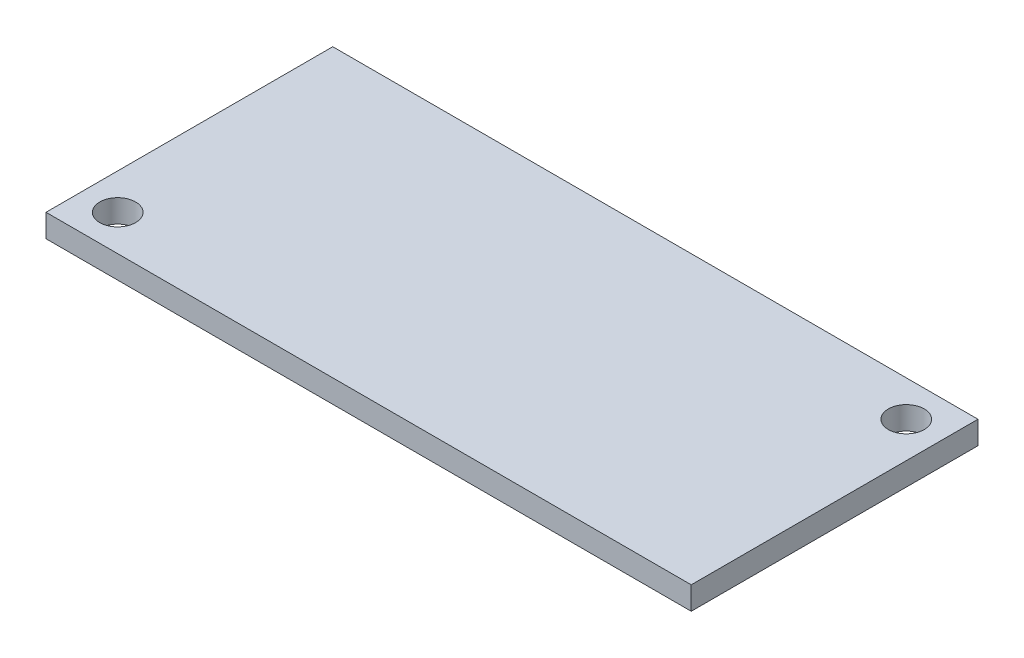
ISO-10303-21;
HEADER;
FILE_DESCRIPTION(('STEP AP214'),'2;1');
FILE_NAME('part.step','',(''),(''),'','','');
FILE_SCHEMA(('AUTOMOTIVE_DESIGN { 1 0 10303 214 1 1 1 1 }'));
ENDSEC;
DATA;
#1=APPLICATION_CONTEXT('core data for automotive mechanical design processes');
#2=APPLICATION_PROTOCOL_DEFINITION('international standard','automotive_design',2000,#1);
#3=PRODUCT_CONTEXT('',#1,'mechanical');
#4=PRODUCT('Part','Part','',(#3));
#5=PRODUCT_RELATED_PRODUCT_CATEGORY('part','',(#4));
#6=PRODUCT_DEFINITION_FORMATION('','',#4);
#7=PRODUCT_DEFINITION_CONTEXT('part definition',#1,'design');
#8=PRODUCT_DEFINITION('design','',#6,#7);
#9=PRODUCT_DEFINITION_SHAPE('','',#8);
#10=(LENGTH_UNIT() NAMED_UNIT(*) SI_UNIT(.MILLI.,.METRE.));
#11=(NAMED_UNIT(*) PLANE_ANGLE_UNIT() SI_UNIT($,.RADIAN.));
#12=(NAMED_UNIT(*) SI_UNIT($,.STERADIAN.) SOLID_ANGLE_UNIT());
#13=UNCERTAINTY_MEASURE_WITH_UNIT(LENGTH_MEASURE(1.E-05),#10,'distance_accuracy_value','');
#14=(GEOMETRIC_REPRESENTATION_CONTEXT(3) GLOBAL_UNCERTAINTY_ASSIGNED_CONTEXT((#13)) GLOBAL_UNIT_ASSIGNED_CONTEXT((#10,
#11,#12)) REPRESENTATION_CONTEXT('',''));
#15=CARTESIAN_POINT('',(0.,0.,0.));
#16=DIRECTION('',(0.,0.,1.));
#17=DIRECTION('',(1.,0.,0.));
#18=AXIS2_PLACEMENT_3D('',#15,#16,#17);
#19=CARTESIAN_POINT('',(22.5,1.6,10.));
#20=DIRECTION('',(-1.,0.,0.));
#21=DIRECTION('',(0.,0.,1.));
#22=AXIS2_PLACEMENT_3D('',#19,#20,#21);
#23=PLANE('',#22);
#24=DIRECTION('',(0.,0.,-1.));
#25=VECTOR('',#24,1.);
#26=CARTESIAN_POINT('',(22.5,0.,10.));
#27=LINE('',#26,#25);
#28=CARTESIAN_POINT('',(22.5,0.,10.));
#29=VERTEX_POINT('',#28);
#30=CARTESIAN_POINT('',(22.5,0.,-10.));
#31=VERTEX_POINT('',#30);
#32=EDGE_CURVE('E95',#29,#31,#27,.T.);
#33=ORIENTED_EDGE('',*,*,#32,.T.);
#34=DIRECTION('',(0.,-1.,0.));
#35=VECTOR('',#34,1.);
#36=CARTESIAN_POINT('',(22.5,1.6,-10.));
#37=LINE('',#36,#35);
#38=CARTESIAN_POINT('',(22.5,1.6,-10.));
#39=VERTEX_POINT('',#38);
#40=EDGE_CURVE('E11',#39,#31,#37,.T.);
#41=ORIENTED_EDGE('',*,*,#40,.F.);
#42=DIRECTION('',(0.,0.,-1.));
#43=VECTOR('',#42,1.);
#44=CARTESIAN_POINT('',(22.5,1.6,10.));
#45=LINE('',#44,#43);
#46=CARTESIAN_POINT('',(22.5,1.6,10.));
#47=VERTEX_POINT('',#46);
#48=EDGE_CURVE('E83',#47,#39,#45,.T.);
#49=ORIENTED_EDGE('',*,*,#48,.F.);
#50=DIRECTION('',(0.,-1.,0.));
#51=VECTOR('',#50,1.);
#52=CARTESIAN_POINT('',(22.5,1.6,10.));
#53=LINE('',#52,#51);
#54=EDGE_CURVE('E91',#47,#29,#53,.T.);
#55=ORIENTED_EDGE('',*,*,#54,.T.);
#56=EDGE_LOOP('',(#33,#41,#49,#55));
#57=FACE_BOUND('',#56,.T.);
#58=ADVANCED_FACE('F32',(#57),#23,.F.);
#59=CARTESIAN_POINT('',(-22.5,1.6,-10.));
#60=DIRECTION('',(0.,0.,1.));
#61=DIRECTION('',(1.,0.,0.));
#62=AXIS2_PLACEMENT_3D('',#59,#60,#61);
#63=PLANE('',#62);
#64=DIRECTION('',(-1.,0.,0.));
#65=VECTOR('',#64,1.);
#66=CARTESIAN_POINT('',(-22.5,0.,-10.));
#67=LINE('',#66,#65);
#68=CARTESIAN_POINT('',(-22.5,0.,-10.));
#69=VERTEX_POINT('',#68);
#70=EDGE_CURVE('E87',#31,#69,#67,.T.);
#71=ORIENTED_EDGE('',*,*,#70,.T.);
#72=DIRECTION('',(0.,-1.,0.));
#73=VECTOR('',#72,1.);
#74=CARTESIAN_POINT('',(-22.5,1.6,-10.));
#75=LINE('',#74,#73);
#76=CARTESIAN_POINT('',(-22.5,1.6,-10.));
#77=VERTEX_POINT('',#76);
#78=EDGE_CURVE('E40',#77,#69,#75,.T.);
#79=ORIENTED_EDGE('',*,*,#78,.F.);
#80=DIRECTION('',(-1.,0.,0.));
#81=VECTOR('',#80,1.);
#82=CARTESIAN_POINT('',(-22.5,1.6,-10.));
#83=LINE('',#82,#81);
#84=EDGE_CURVE('E78',#39,#77,#83,.T.);
#85=ORIENTED_EDGE('',*,*,#84,.F.);
#86=ORIENTED_EDGE('',*,*,#40,.T.);
#87=EDGE_LOOP('',(#71,#79,#85,#86));
#88=FACE_BOUND('',#87,.T.);
#89=ADVANCED_FACE('F86',(#88),#63,.F.);
#90=CARTESIAN_POINT('',(-22.5,1.6,10.));
#91=DIRECTION('',(1.,0.,0.));
#92=DIRECTION('',(0.,0.,-1.));
#93=AXIS2_PLACEMENT_3D('',#90,#91,#92);
#94=PLANE('',#93);
#95=DIRECTION('',(0.,0.,1.));
#96=VECTOR('',#95,1.);
#97=CARTESIAN_POINT('',(-22.5,0.,10.));
#98=LINE('',#97,#96);
#99=CARTESIAN_POINT('',(-22.5,0.,10.));
#100=VERTEX_POINT('',#99);
#101=EDGE_CURVE('E65',#69,#100,#98,.T.);
#102=ORIENTED_EDGE('',*,*,#101,.T.);
#103=DIRECTION('',(0.,-1.,0.));
#104=VECTOR('',#103,1.);
#105=CARTESIAN_POINT('',(-22.5,1.6,10.));
#106=LINE('',#105,#104);
#107=CARTESIAN_POINT('',(-22.5,1.6,10.));
#108=VERTEX_POINT('',#107);
#109=EDGE_CURVE('E88',#108,#100,#106,.T.);
#110=ORIENTED_EDGE('',*,*,#109,.F.);
#111=DIRECTION('',(0.,0.,1.));
#112=VECTOR('',#111,1.);
#113=CARTESIAN_POINT('',(-22.5,1.6,10.));
#114=LINE('',#113,#112);
#115=EDGE_CURVE('E81',#77,#108,#114,.T.);
#116=ORIENTED_EDGE('',*,*,#115,.F.);
#117=ORIENTED_EDGE('',*,*,#78,.T.);
#118=EDGE_LOOP('',(#102,#110,#116,#117));
#119=FACE_BOUND('',#118,.T.);
#120=ADVANCED_FACE('F89',(#119),#94,.F.);
#121=CARTESIAN_POINT('',(-22.5,1.6,10.));
#122=DIRECTION('',(0.,0.,-1.));
#123=DIRECTION('',(-1.,0.,0.));
#124=AXIS2_PLACEMENT_3D('',#121,#122,#123);
#125=PLANE('',#124);
#126=DIRECTION('',(1.,0.,0.));
#127=VECTOR('',#126,1.);
#128=CARTESIAN_POINT('',(-22.5,0.,10.));
#129=LINE('',#128,#127);
#130=EDGE_CURVE('E71',#100,#29,#129,.T.);
#131=ORIENTED_EDGE('',*,*,#130,.T.);
#132=ORIENTED_EDGE('',*,*,#54,.F.);
#133=DIRECTION('',(1.,0.,0.));
#134=VECTOR('',#133,1.);
#135=CARTESIAN_POINT('',(-22.5,1.6,10.));
#136=LINE('',#135,#134);
#137=EDGE_CURVE('E48',#108,#47,#136,.T.);
#138=ORIENTED_EDGE('',*,*,#137,.F.);
#139=ORIENTED_EDGE('',*,*,#109,.T.);
#140=EDGE_LOOP('',(#131,#132,#138,#139));
#141=FACE_BOUND('',#140,.T.);
#142=ADVANCED_FACE('F103',(#141),#125,.F.);
#143=CARTESIAN_POINT('',(0.,1.6,0.));
#144=DIRECTION('',(0.,-1.,0.));
#145=DIRECTION('',(0.,0.,-1.));
#146=AXIS2_PLACEMENT_3D('',#143,#144,#145);
#147=PLANE('',#146);
#148=CARTESIAN_POINT('',(20.,1.6,-7.5));
#149=DIRECTION('',(0.,1.,0.));
#150=DIRECTION('',(0.,0.,1.));
#151=AXIS2_PLACEMENT_3D('',#148,#149,#150);
#152=CIRCLE('',#151,1.25);
#153=CARTESIAN_POINT('',(20.,1.6,-6.25));
#154=VERTEX_POINT('',#153);
#155=EDGE_CURVE('E115',#154,#154,#152,.T.);
#156=ORIENTED_EDGE('',*,*,#155,.F.);
#157=EDGE_LOOP('',(#156));
#158=FACE_BOUND('',#157,.T.);
#159=CARTESIAN_POINT('',(-20.,1.6,7.5));
#160=DIRECTION('',(0.,1.,0.));
#161=DIRECTION('',(0.,0.,1.));
#162=AXIS2_PLACEMENT_3D('',#159,#160,#161);
#163=CIRCLE('',#162,1.25);
#164=CARTESIAN_POINT('',(-20.,1.6,8.75));
#165=VERTEX_POINT('',#164);
#166=EDGE_CURVE('E109',#165,#165,#163,.T.);
#167=ORIENTED_EDGE('',*,*,#166,.F.);
#168=EDGE_LOOP('',(#167));
#169=FACE_BOUND('',#168,.T.);
#170=ORIENTED_EDGE('',*,*,#48,.T.);
#171=ORIENTED_EDGE('',*,*,#84,.T.);
#172=ORIENTED_EDGE('',*,*,#115,.T.);
#173=ORIENTED_EDGE('',*,*,#137,.T.);
#174=EDGE_LOOP('',(#170,#171,#172,#173));
#175=FACE_BOUND('',#174,.T.);
#176=ADVANCED_FACE('F79',(#158,#169,#175),#147,.F.);
#177=CARTESIAN_POINT('',(0.,0.,0.));
#178=DIRECTION('',(0.,-1.,0.));
#179=DIRECTION('',(0.,0.,-1.));
#180=AXIS2_PLACEMENT_3D('',#177,#178,#179);
#181=PLANE('',#180);
#182=CARTESIAN_POINT('',(20.,0.,-7.5));
#183=DIRECTION('',(0.,1.,0.));
#184=DIRECTION('',(0.,0.,1.));
#185=AXIS2_PLACEMENT_3D('',#182,#183,#184);
#186=CIRCLE('',#185,1.25);
#187=CARTESIAN_POINT('',(20.,0.,-6.25));
#188=VERTEX_POINT('',#187);
#189=EDGE_CURVE('E112',#188,#188,#186,.T.);
#190=ORIENTED_EDGE('',*,*,#189,.T.);
#191=EDGE_LOOP('',(#190));
#192=FACE_BOUND('',#191,.T.);
#193=CARTESIAN_POINT('',(-20.,0.,7.5));
#194=DIRECTION('',(0.,1.,0.));
#195=DIRECTION('',(0.,0.,1.));
#196=AXIS2_PLACEMENT_3D('',#193,#194,#195);
#197=CIRCLE('',#196,1.25);
#198=CARTESIAN_POINT('',(-20.,0.,8.75));
#199=VERTEX_POINT('',#198);
#200=EDGE_CURVE('E98',#199,#199,#197,.T.);
#201=ORIENTED_EDGE('',*,*,#200,.T.);
#202=EDGE_LOOP('',(#201));
#203=FACE_BOUND('',#202,.T.);
#204=ORIENTED_EDGE('',*,*,#32,.F.);
#205=ORIENTED_EDGE('',*,*,#130,.F.);
#206=ORIENTED_EDGE('',*,*,#101,.F.);
#207=ORIENTED_EDGE('',*,*,#70,.F.);
#208=EDGE_LOOP('',(#204,#205,#206,#207));
#209=FACE_BOUND('',#208,.T.);
#210=ADVANCED_FACE('F106',(#192,#203,#209),#181,.T.);
#211=CARTESIAN_POINT('',(-20.,0.,7.5));
#212=DIRECTION('',(0.,1.,0.));
#213=DIRECTION('',(0.,0.,1.));
#214=AXIS2_PLACEMENT_3D('',#211,#212,#213);
#215=CYLINDRICAL_SURFACE('',#214,1.25);
#216=ORIENTED_EDGE('',*,*,#200,.F.);
#217=EDGE_LOOP('',(#216));
#218=FACE_BOUND('',#217,.T.);
#219=ORIENTED_EDGE('',*,*,#166,.T.);
#220=EDGE_LOOP('',(#219));
#221=FACE_BOUND('',#220,.T.);
#222=ADVANCED_FACE('F126',(#218,#221),#215,.F.);
#223=CARTESIAN_POINT('',(20.,0.,-7.5));
#224=DIRECTION('',(0.,1.,0.));
#225=DIRECTION('',(0.,0.,1.));
#226=AXIS2_PLACEMENT_3D('',#223,#224,#225);
#227=CYLINDRICAL_SURFACE('',#226,1.25);
#228=ORIENTED_EDGE('',*,*,#189,.F.);
#229=EDGE_LOOP('',(#228));
#230=FACE_BOUND('',#229,.T.);
#231=ORIENTED_EDGE('',*,*,#155,.T.);
#232=EDGE_LOOP('',(#231));
#233=FACE_BOUND('',#232,.T.);
#234=ADVANCED_FACE('F123',(#230,#233),#227,.F.);
#235=CLOSED_SHELL('',(#58,#89,#120,#142,#176,#210,#222,#234));
#236=MANIFOLD_SOLID_BREP('B2',#235);
#237=ADVANCED_BREP_SHAPE_REPRESENTATION('',(#18,#236),#14);
#238=SHAPE_DEFINITION_REPRESENTATION(#9,#237);
ENDSEC;
END-ISO-10303-21;
